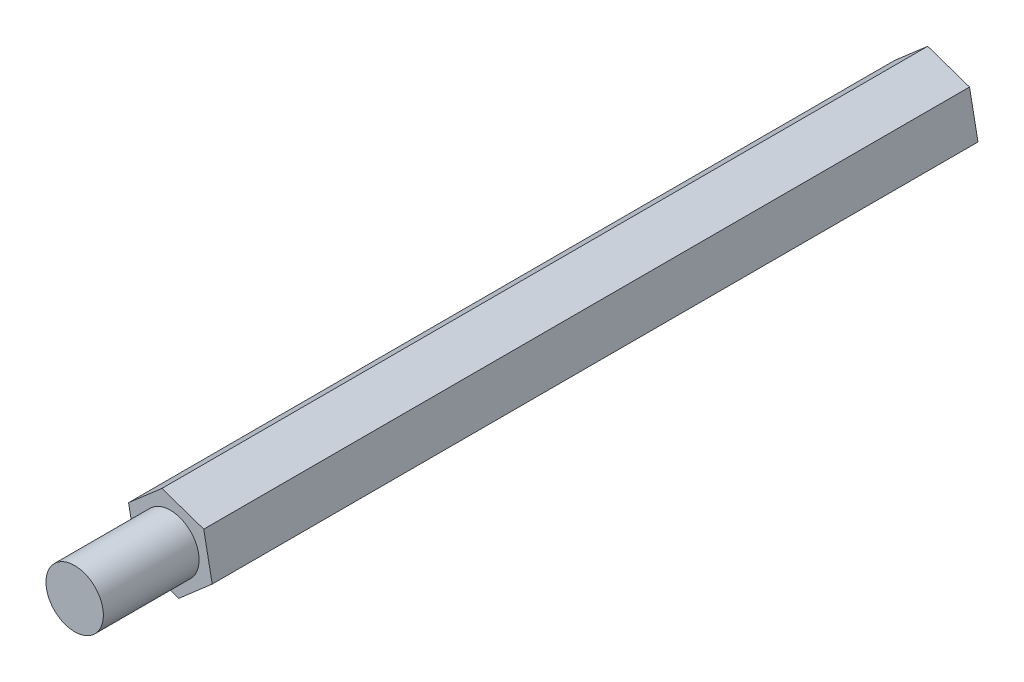
ISO-10303-21;
HEADER;
FILE_DESCRIPTION(('STEP AP214'),'2;1');
FILE_NAME('part.step','',(''),(''),'','','');
FILE_SCHEMA(('AUTOMOTIVE_DESIGN { 1 0 10303 214 1 1 1 1 }'));
ENDSEC;
DATA;
#1=APPLICATION_CONTEXT('core data for automotive mechanical design processes');
#2=APPLICATION_PROTOCOL_DEFINITION('international standard','automotive_design',2000,#1);
#3=PRODUCT_CONTEXT('',#1,'mechanical');
#4=PRODUCT('Part','Part','',(#3));
#5=PRODUCT_RELATED_PRODUCT_CATEGORY('part','',(#4));
#6=PRODUCT_DEFINITION_FORMATION('','',#4);
#7=PRODUCT_DEFINITION_CONTEXT('part definition',#1,'design');
#8=PRODUCT_DEFINITION('design','',#6,#7);
#9=PRODUCT_DEFINITION_SHAPE('','',#8);
#10=(LENGTH_UNIT() NAMED_UNIT(*) SI_UNIT(.MILLI.,.METRE.));
#11=(NAMED_UNIT(*) PLANE_ANGLE_UNIT() SI_UNIT($,.RADIAN.));
#12=(NAMED_UNIT(*) SI_UNIT($,.STERADIAN.) SOLID_ANGLE_UNIT());
#13=UNCERTAINTY_MEASURE_WITH_UNIT(LENGTH_MEASURE(1.E-05),#10,'distance_accuracy_value','');
#14=(GEOMETRIC_REPRESENTATION_CONTEXT(3) GLOBAL_UNCERTAINTY_ASSIGNED_CONTEXT((#13)) GLOBAL_UNIT_ASSIGNED_CONTEXT((#10,
#11,#12)) REPRESENTATION_CONTEXT('',''));
#15=CARTESIAN_POINT('',(0.,0.,0.));
#16=DIRECTION('',(0.,0.,1.));
#17=DIRECTION('',(1.,0.,0.));
#18=AXIS2_PLACEMENT_3D('',#15,#16,#17);
#19=CARTESIAN_POINT('',(0.442066621781068,-2.26669592915336,40.));
#20=DIRECTION('',(-0.656529047493296,0.754300742275616,0.));
#21=DIRECTION('',(-0.754300742275616,-0.656529047493296,0.));
#22=AXIS2_PLACEMENT_3D('',#19,#20,#21);
#23=PLANE('',#22);
#24=DIRECTION('',(0.754300742275616,0.656529047493296,0.));
#25=VECTOR('',#24,1.);
#26=CARTESIAN_POINT('',(0.442066621781068,-2.26669592915336,0.));
#27=LINE('',#26,#25);
#28=CARTESIAN_POINT('',(0.442066621781068,-2.26669592915336,0.));
#29=VERTEX_POINT('',#28);
#30=CARTESIAN_POINT('',(2.18404956819211,-0.750507039949104,0.));
#31=VERTEX_POINT('',#30);
#32=EDGE_CURVE('E123',#29,#31,#27,.T.);
#33=ORIENTED_EDGE('',*,*,#32,.T.);
#34=DIRECTION('',(0.,0.,-1.));
#35=VECTOR('',#34,1.);
#36=CARTESIAN_POINT('',(2.18404956819211,-0.750507039949104,40.));
#37=LINE('',#36,#35);
#38=CARTESIAN_POINT('',(2.18404956819211,-0.750507039949104,40.));
#39=VERTEX_POINT('',#38);
#40=EDGE_CURVE('E40',#39,#31,#37,.T.);
#41=ORIENTED_EDGE('',*,*,#40,.F.);
#42=DIRECTION('',(0.754300742275616,0.656529047493296,0.));
#43=VECTOR('',#42,1.);
#44=CARTESIAN_POINT('',(0.442066621781068,-2.26669592915336,40.));
#45=LINE('',#44,#43);
#46=CARTESIAN_POINT('',(0.442066621781068,-2.26669592915336,40.));
#47=VERTEX_POINT('',#46);
#48=EDGE_CURVE('E134',#47,#39,#45,.T.);
#49=ORIENTED_EDGE('',*,*,#48,.F.);
#50=DIRECTION('',(0.,0.,-1.));
#51=VECTOR('',#50,1.);
#52=CARTESIAN_POINT('',(0.442066621781068,-2.26669592915336,40.));
#53=LINE('',#52,#51);
#54=EDGE_CURVE('E119',#47,#29,#53,.T.);
#55=ORIENTED_EDGE('',*,*,#54,.T.);
#56=EDGE_LOOP('',(#33,#41,#49,#55));
#57=FACE_BOUND('',#56,.T.);
#58=ADVANCED_FACE('F37',(#57),#23,.F.);
#59=CARTESIAN_POINT('',(2.18404956819211,-0.750507039949104,40.));
#60=DIRECTION('',(-0.98150812865079,-0.191420462313786,0.));
#61=DIRECTION('',(0.191420462313786,-0.98150812865079,0.));
#62=AXIS2_PLACEMENT_3D('',#59,#60,#61);
#63=PLANE('',#62);
#64=DIRECTION('',(-0.191420462313786,0.98150812865079,0.));
#65=VECTOR('',#64,1.);
#66=CARTESIAN_POINT('',(2.18404956819211,-0.750507039949104,0.));
#67=LINE('',#66,#65);
#68=CARTESIAN_POINT('',(1.74198294641105,1.51618888920425,0.));
#69=VERTEX_POINT('',#68);
#70=EDGE_CURVE('E126',#31,#69,#67,.T.);
#71=ORIENTED_EDGE('',*,*,#70,.T.);
#72=DIRECTION('',(0.,0.,-1.));
#73=VECTOR('',#72,1.);
#74=CARTESIAN_POINT('',(1.74198294641105,1.51618888920425,40.));
#75=LINE('',#74,#73);
#76=CARTESIAN_POINT('',(1.74198294641105,1.51618888920425,40.));
#77=VERTEX_POINT('',#76);
#78=EDGE_CURVE('E137',#77,#69,#75,.T.);
#79=ORIENTED_EDGE('',*,*,#78,.F.);
#80=DIRECTION('',(-0.191420462313786,0.98150812865079,0.));
#81=VECTOR('',#80,1.);
#82=CARTESIAN_POINT('',(2.18404956819211,-0.750507039949104,40.));
#83=LINE('',#82,#81);
#84=EDGE_CURVE('E92',#39,#77,#83,.T.);
#85=ORIENTED_EDGE('',*,*,#84,.F.);
#86=ORIENTED_EDGE('',*,*,#40,.T.);
#87=EDGE_LOOP('',(#71,#79,#85,#86));
#88=FACE_BOUND('',#87,.T.);
#89=ADVANCED_FACE('F142',(#88),#63,.F.);
#90=CARTESIAN_POINT('',(1.74198294641105,1.51618888920425,40.));
#91=DIRECTION('',(-0.324979081157495,-0.945721204589403,0.));
#92=DIRECTION('',(0.945721204589403,-0.324979081157495,0.));
#93=AXIS2_PLACEMENT_3D('',#90,#91,#92);
#94=PLANE('',#93);
#95=DIRECTION('',(-0.945721204589402,0.324979081157494,0.));
#96=VECTOR('',#95,1.);
#97=CARTESIAN_POINT('',(1.74198294641105,1.51618888920425,0.));
#98=LINE('',#97,#96);
#99=CARTESIAN_POINT('',(-0.442066621781068,2.26669592915336,0.));
#100=VERTEX_POINT('',#99);
#101=EDGE_CURVE('E129',#69,#100,#98,.T.);
#102=ORIENTED_EDGE('',*,*,#101,.T.);
#103=DIRECTION('',(0.,0.,-1.));
#104=VECTOR('',#103,1.);
#105=CARTESIAN_POINT('',(-0.442066621781068,2.26669592915336,40.));
#106=LINE('',#105,#104);
#107=CARTESIAN_POINT('',(-0.442066621781068,2.26669592915336,40.));
#108=VERTEX_POINT('',#107);
#109=EDGE_CURVE('E114',#108,#100,#106,.T.);
#110=ORIENTED_EDGE('',*,*,#109,.F.);
#111=DIRECTION('',(-0.945721204589402,0.324979081157494,0.));
#112=VECTOR('',#111,1.);
#113=CARTESIAN_POINT('',(1.74198294641105,1.51618888920425,40.));
#114=LINE('',#113,#112);
#115=EDGE_CURVE('E105',#77,#108,#114,.T.);
#116=ORIENTED_EDGE('',*,*,#115,.F.);
#117=ORIENTED_EDGE('',*,*,#78,.T.);
#118=EDGE_LOOP('',(#102,#110,#116,#117));
#119=FACE_BOUND('',#118,.T.);
#120=ADVANCED_FACE('F148',(#119),#94,.F.);
#121=CARTESIAN_POINT('',(-0.442066621781068,2.26669592915336,40.));
#122=DIRECTION('',(0.656529047493296,-0.754300742275616,0.));
#123=DIRECTION('',(0.754300742275616,0.656529047493296,0.));
#124=AXIS2_PLACEMENT_3D('',#121,#122,#123);
#125=PLANE('',#124);
#126=DIRECTION('',(-0.754300742275616,-0.656529047493296,0.));
#127=VECTOR('',#126,1.);
#128=CARTESIAN_POINT('',(-0.442066621781068,2.26669592915336,0.));
#129=LINE('',#128,#127);
#130=CARTESIAN_POINT('',(-2.18404956819212,0.750507039949107,0.));
#131=VERTEX_POINT('',#130);
#132=EDGE_CURVE('E113',#100,#131,#129,.T.);
#133=ORIENTED_EDGE('',*,*,#132,.T.);
#134=DIRECTION('',(0.,0.,-1.));
#135=VECTOR('',#134,1.);
#136=CARTESIAN_POINT('',(-2.18404956819212,0.750507039949107,40.));
#137=LINE('',#136,#135);
#138=CARTESIAN_POINT('',(-2.18404956819212,0.750507039949107,40.));
#139=VERTEX_POINT('',#138);
#140=EDGE_CURVE('E110',#139,#131,#137,.T.);
#141=ORIENTED_EDGE('',*,*,#140,.F.);
#142=DIRECTION('',(-0.754300742275616,-0.656529047493296,0.));
#143=VECTOR('',#142,1.);
#144=CARTESIAN_POINT('',(-0.442066621781068,2.26669592915336,40.));
#145=LINE('',#144,#143);
#146=EDGE_CURVE('E99',#108,#139,#145,.T.);
#147=ORIENTED_EDGE('',*,*,#146,.F.);
#148=ORIENTED_EDGE('',*,*,#109,.T.);
#149=EDGE_LOOP('',(#133,#141,#147,#148));
#150=FACE_BOUND('',#149,.T.);
#151=ADVANCED_FACE('F111',(#150),#125,.F.);
#152=CARTESIAN_POINT('',(-2.18404956819212,0.750507039949107,40.));
#153=DIRECTION('',(0.98150812865079,0.191420462313786,0.));
#154=DIRECTION('',(-0.191420462313786,0.98150812865079,0.));
#155=AXIS2_PLACEMENT_3D('',#152,#153,#154);
#156=PLANE('',#155);
#157=DIRECTION('',(0.191420462313786,-0.98150812865079,0.));
#158=VECTOR('',#157,1.);
#159=CARTESIAN_POINT('',(-2.18404956819212,0.750507039949107,0.));
#160=LINE('',#159,#158);
#161=CARTESIAN_POINT('',(-1.74198294641105,-1.51618888920425,0.));
#162=VERTEX_POINT('',#161);
#163=EDGE_CURVE('E77',#131,#162,#160,.T.);
#164=ORIENTED_EDGE('',*,*,#163,.T.);
#165=DIRECTION('',(0.,0.,-1.));
#166=VECTOR('',#165,1.);
#167=CARTESIAN_POINT('',(-1.74198294641105,-1.51618888920425,40.));
#168=LINE('',#167,#166);
#169=CARTESIAN_POINT('',(-1.74198294641105,-1.51618888920425,40.));
#170=VERTEX_POINT('',#169);
#171=EDGE_CURVE('E115',#170,#162,#168,.T.);
#172=ORIENTED_EDGE('',*,*,#171,.F.);
#173=DIRECTION('',(0.191420462313786,-0.98150812865079,0.));
#174=VECTOR('',#173,1.);
#175=CARTESIAN_POINT('',(-2.18404956819212,0.750507039949107,40.));
#176=LINE('',#175,#174);
#177=EDGE_CURVE('E103',#139,#170,#176,.T.);
#178=ORIENTED_EDGE('',*,*,#177,.F.);
#179=ORIENTED_EDGE('',*,*,#140,.T.);
#180=EDGE_LOOP('',(#164,#172,#178,#179));
#181=FACE_BOUND('',#180,.T.);
#182=ADVANCED_FACE('F117',(#181),#156,.F.);
#183=CARTESIAN_POINT('',(-1.74198294641105,-1.51618888920425,40.));
#184=DIRECTION('',(0.324979081157494,0.945721204589403,0.));
#185=DIRECTION('',(-0.945721204589403,0.324979081157494,0.));
#186=AXIS2_PLACEMENT_3D('',#183,#184,#185);
#187=PLANE('',#186);
#188=DIRECTION('',(0.945721204589403,-0.324979081157494,0.));
#189=VECTOR('',#188,1.);
#190=CARTESIAN_POINT('',(-1.74198294641105,-1.51618888920425,0.));
#191=LINE('',#190,#189);
#192=EDGE_CURVE('E83',#162,#29,#191,.T.);
#193=ORIENTED_EDGE('',*,*,#192,.T.);
#194=ORIENTED_EDGE('',*,*,#54,.F.);
#195=DIRECTION('',(0.945721204589403,-0.324979081157494,0.));
#196=VECTOR('',#195,1.);
#197=CARTESIAN_POINT('',(-1.74198294641105,-1.51618888920425,40.));
#198=LINE('',#197,#196);
#199=EDGE_CURVE('E54',#170,#47,#198,.T.);
#200=ORIENTED_EDGE('',*,*,#199,.F.);
#201=ORIENTED_EDGE('',*,*,#171,.T.);
#202=EDGE_LOOP('',(#193,#194,#200,#201));
#203=FACE_BOUND('',#202,.T.);
#204=ADVANCED_FACE('F164',(#203),#187,.F.);
#205=CARTESIAN_POINT('',(0.,0.,40.));
#206=DIRECTION('',(0.,0.,1.));
#207=DIRECTION('',(1.,0.,0.));
#208=AXIS2_PLACEMENT_3D('',#205,#206,#207);
#209=PLANE('',#208);
#210=CARTESIAN_POINT('',(0.,0.,40.));
#211=DIRECTION('',(0.,0.,1.));
#212=DIRECTION('',(1.,0.,0.));
#213=AXIS2_PLACEMENT_3D('',#210,#211,#212);
#214=CIRCLE('',#213,1.5);
#215=CARTESIAN_POINT('',(1.5,0.,40.));
#216=VERTEX_POINT('',#215);
#217=EDGE_CURVE('E11',#216,#216,#214,.T.);
#218=ORIENTED_EDGE('',*,*,#217,.F.);
#219=EDGE_LOOP('',(#218));
#220=FACE_BOUND('',#219,.T.);
#221=ORIENTED_EDGE('',*,*,#48,.T.);
#222=ORIENTED_EDGE('',*,*,#84,.T.);
#223=ORIENTED_EDGE('',*,*,#115,.T.);
#224=ORIENTED_EDGE('',*,*,#146,.T.);
#225=ORIENTED_EDGE('',*,*,#177,.T.);
#226=ORIENTED_EDGE('',*,*,#199,.T.);
#227=EDGE_LOOP('',(#221,#222,#223,#224,#225,#226));
#228=FACE_BOUND('',#227,.T.);
#229=ADVANCED_FACE('F101',(#220,#228),#209,.T.);
#230=CARTESIAN_POINT('',(0.,0.,0.));
#231=DIRECTION('',(0.,0.,1.));
#232=DIRECTION('',(1.,0.,0.));
#233=AXIS2_PLACEMENT_3D('',#230,#231,#232);
#234=PLANE('',#233);
#235=ORIENTED_EDGE('',*,*,#32,.F.);
#236=ORIENTED_EDGE('',*,*,#192,.F.);
#237=ORIENTED_EDGE('',*,*,#163,.F.);
#238=ORIENTED_EDGE('',*,*,#132,.F.);
#239=ORIENTED_EDGE('',*,*,#101,.F.);
#240=ORIENTED_EDGE('',*,*,#70,.F.);
#241=EDGE_LOOP('',(#235,#236,#237,#238,#239,#240));
#242=FACE_BOUND('',#241,.T.);
#243=ADVANCED_FACE('F147',(#242),#234,.F.);
#244=CARTESIAN_POINT('',(0.,0.,45.));
#245=DIRECTION('',(0.,0.,-1.));
#246=DIRECTION('',(-1.,0.,0.));
#247=AXIS2_PLACEMENT_3D('',#244,#245,#246);
#248=CYLINDRICAL_SURFACE('',#247,1.5);
#249=CARTESIAN_POINT('',(0.,0.,45.));
#250=DIRECTION('',(0.,0.,1.));
#251=DIRECTION('',(1.,0.,0.));
#252=AXIS2_PLACEMENT_3D('',#249,#250,#251);
#253=CIRCLE('',#252,1.5);
#254=CARTESIAN_POINT('',(1.5,0.,45.));
#255=VERTEX_POINT('',#254);
#256=EDGE_CURVE('E127',#255,#255,#253,.T.);
#257=ORIENTED_EDGE('',*,*,#256,.F.);
#258=EDGE_LOOP('',(#257));
#259=FACE_BOUND('',#258,.T.);
#260=ORIENTED_EDGE('',*,*,#217,.T.);
#261=EDGE_LOOP('',(#260));
#262=FACE_BOUND('',#261,.T.);
#263=ADVANCED_FACE('F157',(#259,#262),#248,.T.);
#264=CARTESIAN_POINT('',(0.,0.,45.));
#265=DIRECTION('',(0.,0.,1.));
#266=DIRECTION('',(1.,0.,0.));
#267=AXIS2_PLACEMENT_3D('',#264,#265,#266);
#268=PLANE('',#267);
#269=ORIENTED_EDGE('',*,*,#256,.T.);
#270=EDGE_LOOP('',(#269));
#271=FACE_BOUND('',#270,.T.);
#272=ADVANCED_FACE('F155',(#271),#268,.T.);
#273=CLOSED_SHELL('',(#58,#89,#120,#151,#182,#204,#229,#243,#263,#272));
#274=MANIFOLD_SOLID_BREP('B2',#273);
#275=ADVANCED_BREP_SHAPE_REPRESENTATION('',(#18,#274),#14);
#276=SHAPE_DEFINITION_REPRESENTATION(#9,#275);
ENDSEC;
END-ISO-10303-21;
